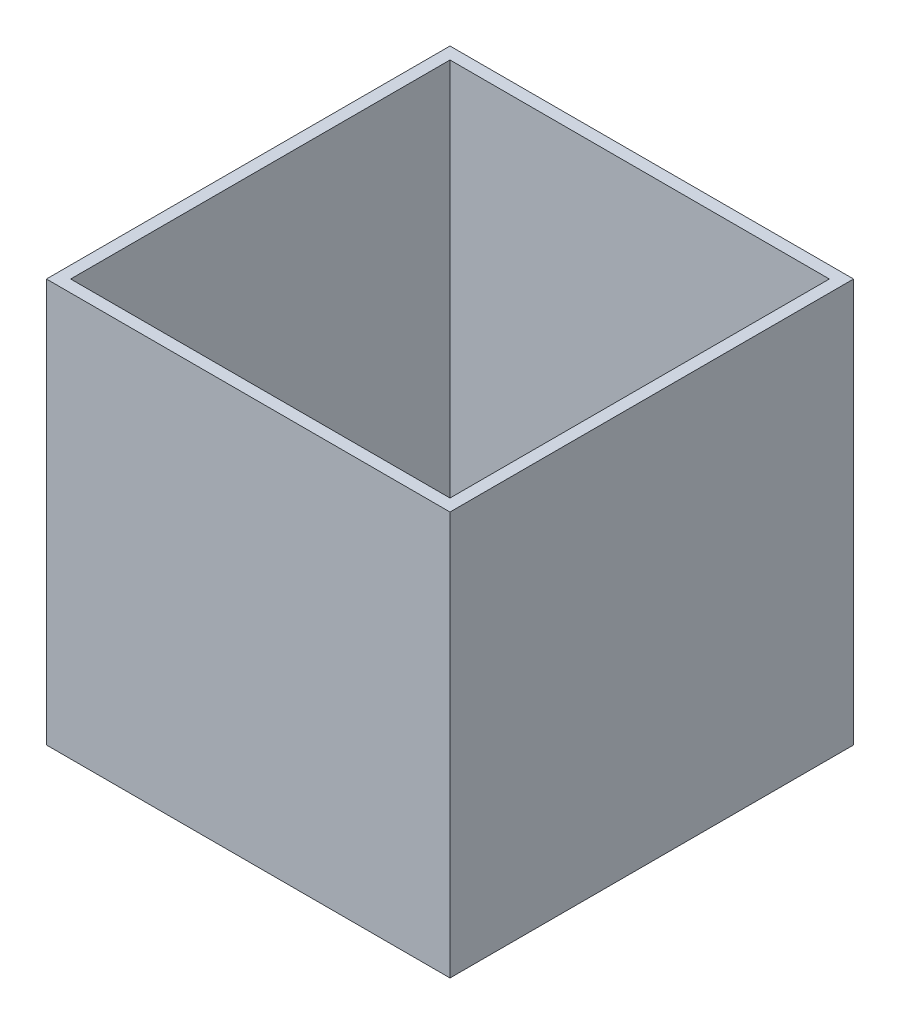
ISO-10303-21;
HEADER;
FILE_DESCRIPTION(('STEP AP214'),'2;1');
FILE_NAME('part.step','',(''),(''),'','','');
FILE_SCHEMA(('AUTOMOTIVE_DESIGN { 1 0 10303 214 1 1 1 1 }'));
ENDSEC;
DATA;
#1=APPLICATION_CONTEXT('core data for automotive mechanical design processes');
#2=APPLICATION_PROTOCOL_DEFINITION('international standard','automotive_design',2000,#1);
#3=PRODUCT_CONTEXT('',#1,'mechanical');
#4=PRODUCT('Part','Part','',(#3));
#5=PRODUCT_RELATED_PRODUCT_CATEGORY('part','',(#4));
#6=PRODUCT_DEFINITION_FORMATION('','',#4);
#7=PRODUCT_DEFINITION_CONTEXT('part definition',#1,'design');
#8=PRODUCT_DEFINITION('design','',#6,#7);
#9=PRODUCT_DEFINITION_SHAPE('','',#8);
#10=(LENGTH_UNIT() NAMED_UNIT(*) SI_UNIT(.MILLI.,.METRE.));
#11=(NAMED_UNIT(*) PLANE_ANGLE_UNIT() SI_UNIT($,.RADIAN.));
#12=(NAMED_UNIT(*) SI_UNIT($,.STERADIAN.) SOLID_ANGLE_UNIT());
#13=UNCERTAINTY_MEASURE_WITH_UNIT(LENGTH_MEASURE(1.E-05),#10,'distance_accuracy_value','');
#14=(GEOMETRIC_REPRESENTATION_CONTEXT(3) GLOBAL_UNCERTAINTY_ASSIGNED_CONTEXT((#13)) GLOBAL_UNIT_ASSIGNED_CONTEXT((#10,
#11,#12)) REPRESENTATION_CONTEXT('',''));
#15=CARTESIAN_POINT('',(0.,0.,0.));
#16=DIRECTION('',(0.,0.,1.));
#17=DIRECTION('',(1.,0.,0.));
#18=AXIS2_PLACEMENT_3D('',#15,#16,#17);
#19=CARTESIAN_POINT('',(0.,30.,0.));
#20=DIRECTION('',(0.,1.,0.));
#21=DIRECTION('',(0.,0.,1.));
#22=AXIS2_PLACEMENT_3D('',#19,#20,#21);
#23=PLANE('',#22);
#24=DIRECTION('',(0.,0.,1.));
#25=VECTOR('',#24,1.);
#26=CARTESIAN_POINT('',(-59.653138935939,30.,-941.60574481769));
#27=LINE('',#26,#25);
#28=CARTESIAN_POINT('',(-59.653138935939,30.,-911.60574481769));
#29=VERTEX_POINT('',#28);
#30=CARTESIAN_POINT('',(-59.6531389359388,30.,28.3942551823103));
#31=VERTEX_POINT('',#30);
#32=EDGE_CURVE('E199',#29,#31,#27,.T.);
#33=ORIENTED_EDGE('',*,*,#32,.T.);
#34=DIRECTION('',(1.,0.,0.));
#35=VECTOR('',#34,1.);
#36=CARTESIAN_POINT('',(-89.6531389359388,30.,28.3942551823103));
#37=LINE('',#36,#35);
#38=CARTESIAN_POINT('',(880.346861064061,30.,28.3942551823103));
#39=VERTEX_POINT('',#38);
#40=EDGE_CURVE('E202',#31,#39,#37,.T.);
#41=ORIENTED_EDGE('',*,*,#40,.T.);
#42=DIRECTION('',(0.,0.,-1.));
#43=VECTOR('',#42,1.);
#44=CARTESIAN_POINT('',(880.346861064061,30.,-941.60574481769));
#45=LINE('',#44,#43);
#46=CARTESIAN_POINT('',(880.346861064061,30.,-911.60574481769));
#47=VERTEX_POINT('',#46);
#48=EDGE_CURVE('E214',#39,#47,#45,.T.);
#49=ORIENTED_EDGE('',*,*,#48,.T.);
#50=DIRECTION('',(-1.,0.,0.));
#51=VECTOR('',#50,1.);
#52=CARTESIAN_POINT('',(-89.653138935939,30.,-911.60574481769));
#53=LINE('',#52,#51);
#54=EDGE_CURVE('E218',#47,#29,#53,.T.);
#55=ORIENTED_EDGE('',*,*,#54,.T.);
#56=EDGE_LOOP('',(#33,#41,#49,#55));
#57=FACE_BOUND('',#56,.T.);
#58=DIRECTION('',(0.,0.,-1.));
#59=VECTOR('',#58,1.);
#60=CARTESIAN_POINT('',(500.346861064061,30.,-371.60574481769));
#61=LINE('',#60,#59);
#62=CARTESIAN_POINT('',(500.346861064061,30.,-371.60574481769));
#63=VERTEX_POINT('',#62);
#64=CARTESIAN_POINT('',(500.346861064061,30.,-431.60574481769));
#65=VERTEX_POINT('',#64);
#66=EDGE_CURVE('E148',#63,#65,#61,.T.);
#67=ORIENTED_EDGE('',*,*,#66,.F.);
#68=DIRECTION('',(1.,0.,0.));
#69=VECTOR('',#68,1.);
#70=CARTESIAN_POINT('',(340.346861064061,30.,-371.60574481769));
#71=LINE('',#70,#69);
#72=CARTESIAN_POINT('',(340.346861064061,30.,-371.60574481769));
#73=VERTEX_POINT('',#72);
#74=EDGE_CURVE('E48',#73,#63,#71,.T.);
#75=ORIENTED_EDGE('',*,*,#74,.F.);
#76=DIRECTION('',(0.,0.,1.));
#77=VECTOR('',#76,1.);
#78=CARTESIAN_POINT('',(340.346861064061,30.,-371.60574481769));
#79=LINE('',#78,#77);
#80=CARTESIAN_POINT('',(340.346861064061,30.,-511.60574481769));
#81=VERTEX_POINT('',#80);
#82=EDGE_CURVE('E186',#81,#73,#79,.T.);
#83=ORIENTED_EDGE('',*,*,#82,.F.);
#84=DIRECTION('',(-1.,0.,0.));
#85=VECTOR('',#84,1.);
#86=CARTESIAN_POINT('',(340.346861064061,30.,-511.60574481769));
#87=LINE('',#86,#85);
#88=CARTESIAN_POINT('',(480.346861064061,30.,-511.60574481769));
#89=VERTEX_POINT('',#88);
#90=EDGE_CURVE('E184',#89,#81,#87,.T.);
#91=ORIENTED_EDGE('',*,*,#90,.F.);
#92=DIRECTION('',(0.,0.,-1.));
#93=VECTOR('',#92,1.);
#94=CARTESIAN_POINT('',(480.346861064061,30.,-371.60574481769));
#95=LINE('',#94,#93);
#96=CARTESIAN_POINT('',(480.346861064061,30.,-431.60574481769));
#97=VERTEX_POINT('',#96);
#98=EDGE_CURVE('E172',#97,#89,#95,.T.);
#99=ORIENTED_EDGE('',*,*,#98,.F.);
#100=DIRECTION('',(-1.,0.,0.));
#101=VECTOR('',#100,1.);
#102=CARTESIAN_POINT('',(500.346861064061,30.,-431.60574481769));
#103=LINE('',#102,#101);
#104=EDGE_CURVE('E55',#65,#97,#103,.T.);
#105=ORIENTED_EDGE('',*,*,#104,.F.);
#106=EDGE_LOOP('',(#67,#75,#83,#91,#99,#105));
#107=FACE_BOUND('',#106,.T.);
#108=ADVANCED_FACE('F33',(#57,#107),#23,.T.);
#109=CARTESIAN_POINT('',(480.346861064061,230.,-371.60574481769));
#110=DIRECTION('',(-1.,0.,0.));
#111=DIRECTION('',(0.,0.,1.));
#112=AXIS2_PLACEMENT_3D('',#109,#110,#111);
#113=PLANE('',#112);
#114=DIRECTION('',(0.,1.,0.));
#115=VECTOR('',#114,1.);
#116=CARTESIAN_POINT('',(480.346861064061,30.,-431.60574481769));
#117=LINE('',#116,#115);
#118=CARTESIAN_POINT('',(480.346861064061,80.,-431.60574481769));
#119=VERTEX_POINT('',#118);
#120=EDGE_CURVE('E155',#97,#119,#117,.T.);
#121=ORIENTED_EDGE('',*,*,#120,.F.);
#122=ORIENTED_EDGE('',*,*,#98,.T.);
#123=DIRECTION('',(0.,-1.,0.));
#124=VECTOR('',#123,1.);
#125=CARTESIAN_POINT('',(480.346861064061,230.,-511.60574481769));
#126=LINE('',#125,#124);
#127=CARTESIAN_POINT('',(480.346861064061,230.,-511.60574481769));
#128=VERTEX_POINT('',#127);
#129=EDGE_CURVE('E196',#128,#89,#126,.T.);
#130=ORIENTED_EDGE('',*,*,#129,.F.);
#131=DIRECTION('',(0.,0.,-1.));
#132=VECTOR('',#131,1.);
#133=CARTESIAN_POINT('',(480.346861064061,230.,-371.60574481769));
#134=LINE('',#133,#132);
#135=CARTESIAN_POINT('',(480.346861064061,230.,-371.60574481769));
#136=VERTEX_POINT('',#135);
#137=EDGE_CURVE('E173',#136,#128,#134,.T.);
#138=ORIENTED_EDGE('',*,*,#137,.F.);
#139=DIRECTION('',(0.,-1.,0.));
#140=VECTOR('',#139,1.);
#141=CARTESIAN_POINT('',(480.346861064061,230.,-371.60574481769));
#142=LINE('',#141,#140);
#143=CARTESIAN_POINT('',(480.346861064061,80.,-371.60574481769));
#144=VERTEX_POINT('',#143);
#145=EDGE_CURVE('E182',#136,#144,#142,.T.);
#146=ORIENTED_EDGE('',*,*,#145,.T.);
#147=DIRECTION('',(0.,0.,1.));
#148=VECTOR('',#147,1.);
#149=CARTESIAN_POINT('',(480.346861064061,80.,-371.60574481769));
#150=LINE('',#149,#148);
#151=EDGE_CURVE('E167',#119,#144,#150,.T.);
#152=ORIENTED_EDGE('',*,*,#151,.F.);
#153=EDGE_LOOP('',(#121,#122,#130,#138,#146,#152));
#154=FACE_BOUND('',#153,.T.);
#155=ADVANCED_FACE('F280',(#154),#113,.F.);
#156=CARTESIAN_POINT('',(-89.653138935939,1000.,-941.60574481769));
#157=DIRECTION('',(1.,0.,0.));
#158=DIRECTION('',(0.,0.,-1.));
#159=AXIS2_PLACEMENT_3D('',#156,#157,#158);
#160=PLANE('',#159);
#161=DIRECTION('',(0.,0.,1.));
#162=VECTOR('',#161,1.);
#163=CARTESIAN_POINT('',(-89.653138935939,0.,-941.60574481769));
#164=LINE('',#163,#162);
#165=CARTESIAN_POINT('',(-89.653138935939,0.,-941.60574481769));
#166=VERTEX_POINT('',#165);
#167=CARTESIAN_POINT('',(-89.6531389359388,0.,58.3942551823103));
#168=VERTEX_POINT('',#167);
#169=EDGE_CURVE('E206',#166,#168,#164,.T.);
#170=ORIENTED_EDGE('',*,*,#169,.T.);
#171=DIRECTION('',(0.,-1.,0.));
#172=VECTOR('',#171,1.);
#173=CARTESIAN_POINT('',(-89.6531389359388,1000.,58.3942551823103));
#174=LINE('',#173,#172);
#175=CARTESIAN_POINT('',(-89.6531389359388,1000.,58.3942551823103));
#176=VERTEX_POINT('',#175);
#177=EDGE_CURVE('E11',#176,#168,#174,.T.);
#178=ORIENTED_EDGE('',*,*,#177,.F.);
#179=DIRECTION('',(0.,0.,1.));
#180=VECTOR('',#179,1.);
#181=CARTESIAN_POINT('',(-89.653138935939,1000.,-941.60574481769));
#182=LINE('',#181,#180);
#183=CARTESIAN_POINT('',(-89.653138935939,1000.,-941.60574481769));
#184=VERTEX_POINT('',#183);
#185=EDGE_CURVE('E230',#184,#176,#182,.T.);
#186=ORIENTED_EDGE('',*,*,#185,.F.);
#187=DIRECTION('',(0.,-1.,0.));
#188=VECTOR('',#187,1.);
#189=CARTESIAN_POINT('',(-89.653138935939,1000.,-941.60574481769));
#190=LINE('',#189,#188);
#191=EDGE_CURVE('E240',#184,#166,#190,.T.);
#192=ORIENTED_EDGE('',*,*,#191,.T.);
#193=EDGE_LOOP('',(#170,#178,#186,#192));
#194=FACE_BOUND('',#193,.T.);
#195=ADVANCED_FACE('F35',(#194),#160,.F.);
#196=CARTESIAN_POINT('',(-89.6531389359388,1000.,58.3942551823103));
#197=DIRECTION('',(0.,0.,-1.));
#198=DIRECTION('',(-1.,0.,0.));
#199=AXIS2_PLACEMENT_3D('',#196,#197,#198);
#200=PLANE('',#199);
#201=DIRECTION('',(1.,0.,0.));
#202=VECTOR('',#201,1.);
#203=CARTESIAN_POINT('',(-89.6531389359388,0.,58.3942551823103));
#204=LINE('',#203,#202);
#205=CARTESIAN_POINT('',(910.346861064061,0.,58.3942551823103));
#206=VERTEX_POINT('',#205);
#207=EDGE_CURVE('E243',#168,#206,#204,.T.);
#208=ORIENTED_EDGE('',*,*,#207,.T.);
#209=DIRECTION('',(0.,-1.,0.));
#210=VECTOR('',#209,1.);
#211=CARTESIAN_POINT('',(910.346861064061,1000.,58.3942551823103));
#212=LINE('',#211,#210);
#213=CARTESIAN_POINT('',(910.346861064061,1000.,58.3942551823103));
#214=VERTEX_POINT('',#213);
#215=EDGE_CURVE('E41',#214,#206,#212,.T.);
#216=ORIENTED_EDGE('',*,*,#215,.F.);
#217=DIRECTION('',(1.,0.,0.));
#218=VECTOR('',#217,1.);
#219=CARTESIAN_POINT('',(-89.6531389359388,1000.,58.3942551823103));
#220=LINE('',#219,#218);
#221=EDGE_CURVE('E233',#176,#214,#220,.T.);
#222=ORIENTED_EDGE('',*,*,#221,.F.);
#223=ORIENTED_EDGE('',*,*,#177,.T.);
#224=EDGE_LOOP('',(#208,#216,#222,#223));
#225=FACE_BOUND('',#224,.T.);
#226=ADVANCED_FACE('F273',(#225),#200,.F.);
#227=CARTESIAN_POINT('',(910.346861064061,1000.,-941.60574481769));
#228=DIRECTION('',(-1.,0.,0.));
#229=DIRECTION('',(0.,0.,1.));
#230=AXIS2_PLACEMENT_3D('',#227,#228,#229);
#231=PLANE('',#230);
#232=DIRECTION('',(0.,0.,-1.));
#233=VECTOR('',#232,1.);
#234=CARTESIAN_POINT('',(910.346861064061,0.,-941.60574481769));
#235=LINE('',#234,#233);
#236=CARTESIAN_POINT('',(910.346861064061,0.,-941.60574481769));
#237=VERTEX_POINT('',#236);
#238=EDGE_CURVE('E245',#206,#237,#235,.T.);
#239=ORIENTED_EDGE('',*,*,#238,.T.);
#240=DIRECTION('',(0.,-1.,0.));
#241=VECTOR('',#240,1.);
#242=CARTESIAN_POINT('',(910.346861064061,1000.,-941.60574481769));
#243=LINE('',#242,#241);
#244=CARTESIAN_POINT('',(910.346861064061,1000.,-941.60574481769));
#245=VERTEX_POINT('',#244);
#246=EDGE_CURVE('E250',#245,#237,#243,.T.);
#247=ORIENTED_EDGE('',*,*,#246,.F.);
#248=DIRECTION('',(0.,0.,-1.));
#249=VECTOR('',#248,1.);
#250=CARTESIAN_POINT('',(910.346861064061,1000.,-941.60574481769));
#251=LINE('',#250,#249);
#252=EDGE_CURVE('E236',#214,#245,#251,.T.);
#253=ORIENTED_EDGE('',*,*,#252,.F.);
#254=ORIENTED_EDGE('',*,*,#215,.T.);
#255=EDGE_LOOP('',(#239,#247,#253,#254));
#256=FACE_BOUND('',#255,.T.);
#257=ADVANCED_FACE('F257',(#256),#231,.F.);
#258=CARTESIAN_POINT('',(-89.653138935939,1000.,-941.60574481769));
#259=DIRECTION('',(0.,0.,1.));
#260=DIRECTION('',(1.,0.,0.));
#261=AXIS2_PLACEMENT_3D('',#258,#259,#260);
#262=PLANE('',#261);
#263=DIRECTION('',(-1.,0.,0.));
#264=VECTOR('',#263,1.);
#265=CARTESIAN_POINT('',(-89.653138935939,0.,-941.60574481769));
#266=LINE('',#265,#264);
#267=EDGE_CURVE('E234',#237,#166,#266,.T.);
#268=ORIENTED_EDGE('',*,*,#267,.T.);
#269=ORIENTED_EDGE('',*,*,#191,.F.);
#270=DIRECTION('',(-1.,0.,0.));
#271=VECTOR('',#270,1.);
#272=CARTESIAN_POINT('',(-89.653138935939,1000.,-941.60574481769));
#273=LINE('',#272,#271);
#274=EDGE_CURVE('E238',#245,#184,#273,.T.);
#275=ORIENTED_EDGE('',*,*,#274,.F.);
#276=ORIENTED_EDGE('',*,*,#246,.T.);
#277=EDGE_LOOP('',(#268,#269,#275,#276));
#278=FACE_BOUND('',#277,.T.);
#279=ADVANCED_FACE('F266',(#278),#262,.F.);
#280=CARTESIAN_POINT('',(0.,1000.,0.));
#281=DIRECTION('',(0.,1.,0.));
#282=DIRECTION('',(0.,0.,1.));
#283=AXIS2_PLACEMENT_3D('',#280,#281,#282);
#284=PLANE('',#283);
#285=DIRECTION('',(0.,0.,1.));
#286=VECTOR('',#285,1.);
#287=CARTESIAN_POINT('',(-59.653138935939,1000.,-941.60574481769));
#288=LINE('',#287,#286);
#289=CARTESIAN_POINT('',(-59.653138935939,1000.,-911.60574481769));
#290=VERTEX_POINT('',#289);
#291=CARTESIAN_POINT('',(-59.6531389359388,1000.,28.3942551823103));
#292=VERTEX_POINT('',#291);
#293=EDGE_CURVE('E222',#290,#292,#288,.T.);
#294=ORIENTED_EDGE('',*,*,#293,.F.);
#295=DIRECTION('',(-1.,0.,0.));
#296=VECTOR('',#295,1.);
#297=CARTESIAN_POINT('',(-89.653138935939,1000.,-911.60574481769));
#298=LINE('',#297,#296);
#299=CARTESIAN_POINT('',(880.346861064061,1000.,-911.60574481769));
#300=VERTEX_POINT('',#299);
#301=EDGE_CURVE('E212',#300,#290,#298,.T.);
#302=ORIENTED_EDGE('',*,*,#301,.F.);
#303=DIRECTION('',(0.,0.,-1.));
#304=VECTOR('',#303,1.);
#305=CARTESIAN_POINT('',(880.346861064061,1000.,-941.60574481769));
#306=LINE('',#305,#304);
#307=CARTESIAN_POINT('',(880.346861064061,1000.,28.3942551823103));
#308=VERTEX_POINT('',#307);
#309=EDGE_CURVE('E226',#308,#300,#306,.T.);
#310=ORIENTED_EDGE('',*,*,#309,.F.);
#311=DIRECTION('',(1.,0.,0.));
#312=VECTOR('',#311,1.);
#313=CARTESIAN_POINT('',(-89.6531389359388,1000.,28.3942551823103));
#314=LINE('',#313,#312);
#315=EDGE_CURVE('E224',#292,#308,#314,.T.);
#316=ORIENTED_EDGE('',*,*,#315,.F.);
#317=EDGE_LOOP('',(#294,#302,#310,#316));
#318=FACE_BOUND('',#317,.T.);
#319=ORIENTED_EDGE('',*,*,#185,.T.);
#320=ORIENTED_EDGE('',*,*,#221,.T.);
#321=ORIENTED_EDGE('',*,*,#252,.T.);
#322=ORIENTED_EDGE('',*,*,#274,.T.);
#323=EDGE_LOOP('',(#319,#320,#321,#322));
#324=FACE_BOUND('',#323,.T.);
#325=ADVANCED_FACE('F272',(#318,#324),#284,.T.);
#326=CARTESIAN_POINT('',(0.,0.,0.));
#327=DIRECTION('',(0.,1.,0.));
#328=DIRECTION('',(0.,0.,1.));
#329=AXIS2_PLACEMENT_3D('',#326,#327,#328);
#330=PLANE('',#329);
#331=ORIENTED_EDGE('',*,*,#169,.F.);
#332=ORIENTED_EDGE('',*,*,#267,.F.);
#333=ORIENTED_EDGE('',*,*,#238,.F.);
#334=ORIENTED_EDGE('',*,*,#207,.F.);
#335=EDGE_LOOP('',(#331,#332,#333,#334));
#336=FACE_BOUND('',#335,.T.);
#337=ADVANCED_FACE('F263',(#336),#330,.F.);
#338=CARTESIAN_POINT('',(-59.653138935939,1000.,-941.60574481769));
#339=DIRECTION('',(1.,0.,0.));
#340=DIRECTION('',(0.,0.,-1.));
#341=AXIS2_PLACEMENT_3D('',#338,#339,#340);
#342=PLANE('',#341);
#343=ORIENTED_EDGE('',*,*,#32,.F.);
#344=DIRECTION('',(0.,-1.,0.));
#345=VECTOR('',#344,1.);
#346=CARTESIAN_POINT('',(-59.653138935939,1000.,-911.60574481769));
#347=LINE('',#346,#345);
#348=EDGE_CURVE('E208',#290,#29,#347,.T.);
#349=ORIENTED_EDGE('',*,*,#348,.F.);
#350=ORIENTED_EDGE('',*,*,#293,.T.);
#351=DIRECTION('',(0.,-1.,0.));
#352=VECTOR('',#351,1.);
#353=CARTESIAN_POINT('',(-59.6531389359388,1000.,28.3942551823103));
#354=LINE('',#353,#352);
#355=EDGE_CURVE('E203',#292,#31,#354,.T.);
#356=ORIENTED_EDGE('',*,*,#355,.T.);
#357=EDGE_LOOP('',(#343,#349,#350,#356));
#358=FACE_BOUND('',#357,.T.);
#359=ADVANCED_FACE('F298',(#358),#342,.T.);
#360=CARTESIAN_POINT('',(-89.6531389359388,1000.,28.3942551823103));
#361=DIRECTION('',(0.,0.,-1.));
#362=DIRECTION('',(-1.,0.,0.));
#363=AXIS2_PLACEMENT_3D('',#360,#361,#362);
#364=PLANE('',#363);
#365=ORIENTED_EDGE('',*,*,#40,.F.);
#366=ORIENTED_EDGE('',*,*,#355,.F.);
#367=ORIENTED_EDGE('',*,*,#315,.T.);
#368=DIRECTION('',(0.,-1.,0.));
#369=VECTOR('',#368,1.);
#370=CARTESIAN_POINT('',(880.346861064061,1000.,28.3942551823103));
#371=LINE('',#370,#369);
#372=EDGE_CURVE('E207',#308,#39,#371,.T.);
#373=ORIENTED_EDGE('',*,*,#372,.T.);
#374=EDGE_LOOP('',(#365,#366,#367,#373));
#375=FACE_BOUND('',#374,.T.);
#376=ADVANCED_FACE('F318',(#375),#364,.T.);
#377=CARTESIAN_POINT('',(880.346861064061,1000.,-941.60574481769));
#378=DIRECTION('',(-1.,0.,0.));
#379=DIRECTION('',(0.,0.,1.));
#380=AXIS2_PLACEMENT_3D('',#377,#378,#379);
#381=PLANE('',#380);
#382=ORIENTED_EDGE('',*,*,#48,.F.);
#383=ORIENTED_EDGE('',*,*,#372,.F.);
#384=ORIENTED_EDGE('',*,*,#309,.T.);
#385=DIRECTION('',(0.,-1.,0.));
#386=VECTOR('',#385,1.);
#387=CARTESIAN_POINT('',(880.346861064061,1000.,-911.60574481769));
#388=LINE('',#387,#386);
#389=EDGE_CURVE('E211',#300,#47,#388,.T.);
#390=ORIENTED_EDGE('',*,*,#389,.T.);
#391=EDGE_LOOP('',(#382,#383,#384,#390));
#392=FACE_BOUND('',#391,.T.);
#393=ADVANCED_FACE('F326',(#392),#381,.T.);
#394=CARTESIAN_POINT('',(-89.653138935939,1000.,-911.60574481769));
#395=DIRECTION('',(0.,0.,1.));
#396=DIRECTION('',(1.,0.,0.));
#397=AXIS2_PLACEMENT_3D('',#394,#395,#396);
#398=PLANE('',#397);
#399=ORIENTED_EDGE('',*,*,#54,.F.);
#400=ORIENTED_EDGE('',*,*,#389,.F.);
#401=ORIENTED_EDGE('',*,*,#301,.T.);
#402=ORIENTED_EDGE('',*,*,#348,.T.);
#403=EDGE_LOOP('',(#399,#400,#401,#402));
#404=FACE_BOUND('',#403,.T.);
#405=ADVANCED_FACE('F291',(#404),#398,.T.);
#406=CARTESIAN_POINT('',(340.346861064061,230.,-511.60574481769));
#407=DIRECTION('',(0.,0.,1.));
#408=DIRECTION('',(1.,0.,0.));
#409=AXIS2_PLACEMENT_3D('',#406,#407,#408);
#410=PLANE('',#409);
#411=ORIENTED_EDGE('',*,*,#90,.T.);
#412=DIRECTION('',(0.,-1.,0.));
#413=VECTOR('',#412,1.);
#414=CARTESIAN_POINT('',(340.346861064061,230.,-511.60574481769));
#415=LINE('',#414,#413);
#416=CARTESIAN_POINT('',(340.346861064061,230.,-511.60574481769));
#417=VERTEX_POINT('',#416);
#418=EDGE_CURVE('E193',#417,#81,#415,.T.);
#419=ORIENTED_EDGE('',*,*,#418,.F.);
#420=DIRECTION('',(-1.,0.,0.));
#421=VECTOR('',#420,1.);
#422=CARTESIAN_POINT('',(340.346861064061,230.,-511.60574481769));
#423=LINE('',#422,#421);
#424=EDGE_CURVE('E176',#128,#417,#423,.T.);
#425=ORIENTED_EDGE('',*,*,#424,.F.);
#426=ORIENTED_EDGE('',*,*,#129,.T.);
#427=EDGE_LOOP('',(#411,#419,#425,#426));
#428=FACE_BOUND('',#427,.T.);
#429=ADVANCED_FACE('F340',(#428),#410,.F.);
#430=CARTESIAN_POINT('',(340.346861064061,230.,-371.60574481769));
#431=DIRECTION('',(1.,0.,0.));
#432=DIRECTION('',(0.,0.,-1.));
#433=AXIS2_PLACEMENT_3D('',#430,#431,#432);
#434=PLANE('',#433);
#435=ORIENTED_EDGE('',*,*,#82,.T.);
#436=DIRECTION('',(0.,-1.,0.));
#437=VECTOR('',#436,1.);
#438=CARTESIAN_POINT('',(340.346861064061,230.,-371.60574481769));
#439=LINE('',#438,#437);
#440=CARTESIAN_POINT('',(340.346861064061,230.,-371.60574481769));
#441=VERTEX_POINT('',#440);
#442=EDGE_CURVE('E191',#441,#73,#439,.T.);
#443=ORIENTED_EDGE('',*,*,#442,.F.);
#444=DIRECTION('',(0.,0.,1.));
#445=VECTOR('',#444,1.);
#446=CARTESIAN_POINT('',(340.346861064061,230.,-371.60574481769));
#447=LINE('',#446,#445);
#448=EDGE_CURVE('E178',#417,#441,#447,.T.);
#449=ORIENTED_EDGE('',*,*,#448,.F.);
#450=ORIENTED_EDGE('',*,*,#418,.T.);
#451=EDGE_LOOP('',(#435,#443,#449,#450));
#452=FACE_BOUND('',#451,.T.);
#453=ADVANCED_FACE('F347',(#452),#434,.F.);
#454=CARTESIAN_POINT('',(340.346861064061,230.,-371.60574481769));
#455=DIRECTION('',(0.,0.,-1.));
#456=DIRECTION('',(-1.,0.,0.));
#457=AXIS2_PLACEMENT_3D('',#454,#455,#456);
#458=PLANE('',#457);
#459=ORIENTED_EDGE('',*,*,#74,.T.);
#460=DIRECTION('',(0.,-1.,0.));
#461=VECTOR('',#460,1.);
#462=CARTESIAN_POINT('',(500.346861064061,30.,-371.60574481769));
#463=LINE('',#462,#461);
#464=CARTESIAN_POINT('',(500.346861064061,80.,-371.60574481769));
#465=VERTEX_POINT('',#464);
#466=EDGE_CURVE('E169',#465,#63,#463,.T.);
#467=ORIENTED_EDGE('',*,*,#466,.F.);
#468=DIRECTION('',(-1.,0.,0.));
#469=VECTOR('',#468,1.);
#470=CARTESIAN_POINT('',(500.346861064061,80.,-371.60574481769));
#471=LINE('',#470,#469);
#472=EDGE_CURVE('E158',#465,#144,#471,.T.);
#473=ORIENTED_EDGE('',*,*,#472,.T.);
#474=ORIENTED_EDGE('',*,*,#145,.F.);
#475=DIRECTION('',(1.,0.,0.));
#476=VECTOR('',#475,1.);
#477=CARTESIAN_POINT('',(340.346861064061,230.,-371.60574481769));
#478=LINE('',#477,#476);
#479=EDGE_CURVE('E180',#441,#136,#478,.T.);
#480=ORIENTED_EDGE('',*,*,#479,.F.);
#481=ORIENTED_EDGE('',*,*,#442,.T.);
#482=EDGE_LOOP('',(#459,#467,#473,#474,#480,#481));
#483=FACE_BOUND('',#482,.T.);
#484=ADVANCED_FACE('F355',(#483),#458,.F.);
#485=CARTESIAN_POINT('',(0.,230.,0.));
#486=DIRECTION('',(0.,-1.,0.));
#487=DIRECTION('',(0.,0.,-1.));
#488=AXIS2_PLACEMENT_3D('',#485,#486,#487);
#489=PLANE('',#488);
#490=CARTESIAN_POINT('',(460.346861064061,230.,-441.60574481769));
#491=DIRECTION('',(0.,1.,0.));
#492=DIRECTION('',(0.,0.,1.));
#493=AXIS2_PLACEMENT_3D('',#490,#491,#492);
#494=CIRCLE('',#493,9.99999999999998);
#495=CARTESIAN_POINT('',(460.346861064061,230.,-431.60574481769));
#496=VERTEX_POINT('',#495);
#497=EDGE_CURVE('E530',#496,#496,#494,.T.);
#498=ORIENTED_EDGE('',*,*,#497,.F.);
#499=EDGE_LOOP('',(#498));
#500=FACE_BOUND('',#499,.T.);
#501=CARTESIAN_POINT('',(410.346861064061,230.,-391.60574481769));
#502=DIRECTION('',(0.,1.,0.));
#503=DIRECTION('',(0.,0.,1.));
#504=AXIS2_PLACEMENT_3D('',#501,#502,#503);
#505=CIRCLE('',#504,10.);
#506=CARTESIAN_POINT('',(410.346861064061,230.,-381.60574481769));
#507=VERTEX_POINT('',#506);
#508=EDGE_CURVE('E529',#507,#507,#505,.T.);
#509=ORIENTED_EDGE('',*,*,#508,.F.);
#510=EDGE_LOOP('',(#509));
#511=FACE_BOUND('',#510,.T.);
#512=CARTESIAN_POINT('',(360.346861064061,230.,-441.60574481769));
#513=DIRECTION('',(0.,1.,0.));
#514=DIRECTION('',(0.,0.,1.));
#515=AXIS2_PLACEMENT_3D('',#512,#513,#514);
#516=CIRCLE('',#515,9.99999999999998);
#517=CARTESIAN_POINT('',(360.346861064061,230.,-431.60574481769));
#518=VERTEX_POINT('',#517);
#519=EDGE_CURVE('E539',#518,#518,#516,.T.);
#520=ORIENTED_EDGE('',*,*,#519,.F.);
#521=EDGE_LOOP('',(#520));
#522=FACE_BOUND('',#521,.T.);
#523=CARTESIAN_POINT('',(410.346861064061,230.,-491.60574481769));
#524=DIRECTION('',(0.,1.,0.));
#525=DIRECTION('',(0.,0.,1.));
#526=AXIS2_PLACEMENT_3D('',#523,#524,#525);
#527=CIRCLE('',#526,9.99999999999991);
#528=CARTESIAN_POINT('',(410.346861064061,230.,-481.60574481769));
#529=VERTEX_POINT('',#528);
#530=EDGE_CURVE('E544',#529,#529,#527,.T.);
#531=ORIENTED_EDGE('',*,*,#530,.F.);
#532=EDGE_LOOP('',(#531));
#533=FACE_BOUND('',#532,.T.);
#534=ORIENTED_EDGE('',*,*,#137,.T.);
#535=ORIENTED_EDGE('',*,*,#424,.T.);
#536=ORIENTED_EDGE('',*,*,#448,.T.);
#537=ORIENTED_EDGE('',*,*,#479,.T.);
#538=EDGE_LOOP('',(#534,#535,#536,#537));
#539=FACE_BOUND('',#538,.T.);
#540=ADVANCED_FACE('F363',(#500,#511,#522,#533,#539),#489,.F.);
#541=CARTESIAN_POINT('',(500.346861064061,30.,-431.60574481769));
#542=DIRECTION('',(0.,0.,1.));
#543=DIRECTION('',(1.,0.,0.));
#544=AXIS2_PLACEMENT_3D('',#541,#542,#543);
#545=PLANE('',#544);
#546=ORIENTED_EDGE('',*,*,#120,.T.);
#547=DIRECTION('',(-1.,0.,0.));
#548=VECTOR('',#547,1.);
#549=CARTESIAN_POINT('',(500.346861064061,80.,-431.60574481769));
#550=LINE('',#549,#548);
#551=CARTESIAN_POINT('',(500.346861064061,80.,-431.60574481769));
#552=VERTEX_POINT('',#551);
#553=EDGE_CURVE('E153',#552,#119,#550,.T.);
#554=ORIENTED_EDGE('',*,*,#553,.F.);
#555=DIRECTION('',(0.,1.,0.));
#556=VECTOR('',#555,1.);
#557=CARTESIAN_POINT('',(500.346861064061,30.,-431.60574481769));
#558=LINE('',#557,#556);
#559=EDGE_CURVE('E141',#65,#552,#558,.T.);
#560=ORIENTED_EDGE('',*,*,#559,.F.);
#561=ORIENTED_EDGE('',*,*,#104,.T.);
#562=EDGE_LOOP('',(#546,#554,#560,#561));
#563=FACE_BOUND('',#562,.T.);
#564=ADVANCED_FACE('F154',(#563),#545,.F.);
#565=CARTESIAN_POINT('',(500.346861064061,80.,-371.60574481769));
#566=DIRECTION('',(0.,-1.,0.));
#567=DIRECTION('',(0.,0.,-1.));
#568=AXIS2_PLACEMENT_3D('',#565,#566,#567);
#569=PLANE('',#568);
#570=ORIENTED_EDGE('',*,*,#151,.T.);
#571=ORIENTED_EDGE('',*,*,#472,.F.);
#572=DIRECTION('',(0.,0.,1.));
#573=VECTOR('',#572,1.);
#574=CARTESIAN_POINT('',(500.346861064061,80.,-371.60574481769));
#575=LINE('',#574,#573);
#576=EDGE_CURVE('E146',#552,#465,#575,.T.);
#577=ORIENTED_EDGE('',*,*,#576,.F.);
#578=ORIENTED_EDGE('',*,*,#553,.T.);
#579=EDGE_LOOP('',(#570,#571,#577,#578));
#580=FACE_BOUND('',#579,.T.);
#581=ADVANCED_FACE('F160',(#580),#569,.F.);
#582=CARTESIAN_POINT('',(500.346861064061,0.,0.));
#583=DIRECTION('',(-1.,0.,0.));
#584=DIRECTION('',(0.,0.,1.));
#585=AXIS2_PLACEMENT_3D('',#582,#583,#584);
#586=PLANE('',#585);
#587=ORIENTED_EDGE('',*,*,#466,.T.);
#588=ORIENTED_EDGE('',*,*,#66,.T.);
#589=ORIENTED_EDGE('',*,*,#559,.T.);
#590=ORIENTED_EDGE('',*,*,#576,.T.);
#591=EDGE_LOOP('',(#587,#588,#589,#590));
#592=FACE_BOUND('',#591,.T.);
#593=ADVANCED_FACE('F144',(#592),#586,.F.);
#594=CARTESIAN_POINT('',(410.346861064061,150.,-491.60574481769));
#595=DIRECTION('',(0.,1.,0.));
#596=DIRECTION('',(0.,0.,1.));
#597=AXIS2_PLACEMENT_3D('',#594,#595,#596);
#598=CYLINDRICAL_SURFACE('',#597,9.99999999999991);
#599=CARTESIAN_POINT('',(410.346861064061,150.,-491.60574481769));
#600=DIRECTION('',(0.,1.,0.));
#601=DIRECTION('',(0.,0.,1.));
#602=AXIS2_PLACEMENT_3D('',#599,#600,#601);
#603=CIRCLE('',#602,9.99999999999991);
#604=CARTESIAN_POINT('',(410.346861064061,150.,-481.60574481769));
#605=VERTEX_POINT('',#604);
#606=EDGE_CURVE('E168',#605,#605,#603,.T.);
#607=ORIENTED_EDGE('',*,*,#606,.F.);
#608=EDGE_LOOP('',(#607));
#609=FACE_BOUND('',#608,.T.);
#610=ORIENTED_EDGE('',*,*,#530,.T.);
#611=EDGE_LOOP('',(#610));
#612=FACE_BOUND('',#611,.T.);
#613=ADVANCED_FACE('F391',(#609,#612),#598,.F.);
#614=CARTESIAN_POINT('',(410.346861064061,150.,-491.60574481769));
#615=DIRECTION('',(0.,1.,0.));
#616=DIRECTION('',(0.,0.,1.));
#617=AXIS2_PLACEMENT_3D('',#614,#615,#616);
#618=PLANE('',#617);
#619=ORIENTED_EDGE('',*,*,#606,.T.);
#620=EDGE_LOOP('',(#619));
#621=FACE_BOUND('',#620,.T.);
#622=ADVANCED_FACE('F397',(#621),#618,.T.);
#623=CARTESIAN_POINT('',(360.346861064061,150.,-441.60574481769));
#624=DIRECTION('',(0.,1.,0.));
#625=DIRECTION('',(0.,0.,1.));
#626=AXIS2_PLACEMENT_3D('',#623,#624,#625);
#627=CYLINDRICAL_SURFACE('',#626,9.99999999999998);
#628=CARTESIAN_POINT('',(360.346861064061,150.,-441.60574481769));
#629=DIRECTION('',(0.,1.,0.));
#630=DIRECTION('',(0.,0.,1.));
#631=AXIS2_PLACEMENT_3D('',#628,#629,#630);
#632=CIRCLE('',#631,9.99999999999998);
#633=CARTESIAN_POINT('',(360.346861064061,150.,-431.60574481769));
#634=VERTEX_POINT('',#633);
#635=EDGE_CURVE('E541',#634,#634,#632,.T.);
#636=ORIENTED_EDGE('',*,*,#635,.F.);
#637=EDGE_LOOP('',(#636));
#638=FACE_BOUND('',#637,.T.);
#639=ORIENTED_EDGE('',*,*,#519,.T.);
#640=EDGE_LOOP('',(#639));
#641=FACE_BOUND('',#640,.T.);
#642=ADVANCED_FACE('F405',(#638,#641),#627,.F.);
#643=CARTESIAN_POINT('',(360.346861064061,150.,-441.60574481769));
#644=DIRECTION('',(0.,1.,0.));
#645=DIRECTION('',(0.,0.,1.));
#646=AXIS2_PLACEMENT_3D('',#643,#644,#645);
#647=PLANE('',#646);
#648=ORIENTED_EDGE('',*,*,#635,.T.);
#649=EDGE_LOOP('',(#648));
#650=FACE_BOUND('',#649,.T.);
#651=ADVANCED_FACE('F413',(#650),#647,.T.);
#652=CARTESIAN_POINT('',(410.346861064061,150.,-391.60574481769));
#653=DIRECTION('',(0.,1.,0.));
#654=DIRECTION('',(0.,0.,1.));
#655=AXIS2_PLACEMENT_3D('',#652,#653,#654);
#656=CYLINDRICAL_SURFACE('',#655,10.);
#657=CARTESIAN_POINT('',(410.346861064061,150.,-391.60574481769));
#658=DIRECTION('',(0.,1.,0.));
#659=DIRECTION('',(0.,0.,1.));
#660=AXIS2_PLACEMENT_3D('',#657,#658,#659);
#661=CIRCLE('',#660,10.);
#662=CARTESIAN_POINT('',(410.346861064061,150.,-381.60574481769));
#663=VERTEX_POINT('',#662);
#664=EDGE_CURVE('E533',#663,#663,#661,.T.);
#665=ORIENTED_EDGE('',*,*,#664,.F.);
#666=EDGE_LOOP('',(#665));
#667=FACE_BOUND('',#666,.T.);
#668=ORIENTED_EDGE('',*,*,#508,.T.);
#669=EDGE_LOOP('',(#668));
#670=FACE_BOUND('',#669,.T.);
#671=ADVANCED_FACE('F421',(#667,#670),#656,.F.);
#672=CARTESIAN_POINT('',(410.346861064061,150.,-391.60574481769));
#673=DIRECTION('',(0.,1.,0.));
#674=DIRECTION('',(0.,0.,1.));
#675=AXIS2_PLACEMENT_3D('',#672,#673,#674);
#676=PLANE('',#675);
#677=ORIENTED_EDGE('',*,*,#664,.T.);
#678=EDGE_LOOP('',(#677));
#679=FACE_BOUND('',#678,.T.);
#680=ADVANCED_FACE('F429',(#679),#676,.T.);
#681=CARTESIAN_POINT('',(460.346861064061,150.,-441.60574481769));
#682=DIRECTION('',(0.,1.,0.));
#683=DIRECTION('',(0.,0.,1.));
#684=AXIS2_PLACEMENT_3D('',#681,#682,#683);
#685=CYLINDRICAL_SURFACE('',#684,9.99999999999998);
#686=CARTESIAN_POINT('',(460.346861064061,150.,-441.60574481769));
#687=DIRECTION('',(0.,1.,0.));
#688=DIRECTION('',(0.,0.,1.));
#689=AXIS2_PLACEMENT_3D('',#686,#687,#688);
#690=CIRCLE('',#689,9.99999999999998);
#691=CARTESIAN_POINT('',(460.346861064061,150.,-431.60574481769));
#692=VERTEX_POINT('',#691);
#693=EDGE_CURVE('E528',#692,#692,#690,.T.);
#694=ORIENTED_EDGE('',*,*,#693,.F.);
#695=EDGE_LOOP('',(#694));
#696=FACE_BOUND('',#695,.T.);
#697=ORIENTED_EDGE('',*,*,#497,.T.);
#698=EDGE_LOOP('',(#697));
#699=FACE_BOUND('',#698,.T.);
#700=ADVANCED_FACE('F437',(#696,#699),#685,.F.);
#701=CARTESIAN_POINT('',(460.346861064061,150.,-441.60574481769));
#702=DIRECTION('',(0.,1.,0.));
#703=DIRECTION('',(0.,0.,1.));
#704=AXIS2_PLACEMENT_3D('',#701,#702,#703);
#705=PLANE('',#704);
#706=ORIENTED_EDGE('',*,*,#693,.T.);
#707=EDGE_LOOP('',(#706));
#708=FACE_BOUND('',#707,.T.);
#709=ADVANCED_FACE('F445',(#708),#705,.T.);
#710=CLOSED_SHELL('',(#108,#155,#195,#226,#257,#279,#325,#337,#359,#376,#393,#405,#429,#453,
#484,#540,#564,#581,#593,#613,#622,#642,#651,#671,#680,#700,#709));
#711=MANIFOLD_SOLID_BREP('B2',#710);
#712=ADVANCED_BREP_SHAPE_REPRESENTATION('',(#18,#711),#14);
#713=SHAPE_DEFINITION_REPRESENTATION(#9,#712);
ENDSEC;
END-ISO-10303-21;
